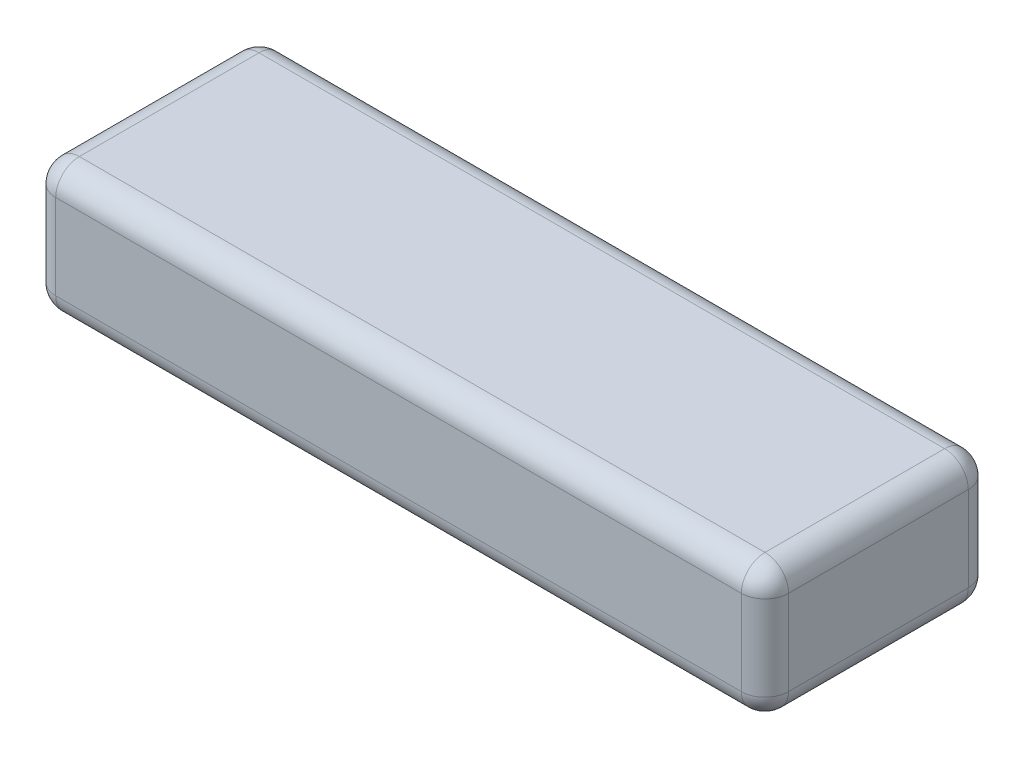
ISO-10303-21;
HEADER;
FILE_DESCRIPTION(('STEP AP214'),'2;1');
FILE_NAME('part.step','',(''),(''),'','','');
FILE_SCHEMA(('AUTOMOTIVE_DESIGN { 1 0 10303 214 1 1 1 1 }'));
ENDSEC;
DATA;
#1=APPLICATION_CONTEXT('core data for automotive mechanical design processes');
#2=APPLICATION_PROTOCOL_DEFINITION('international standard','automotive_design',2000,#1);
#3=PRODUCT_CONTEXT('',#1,'mechanical');
#4=PRODUCT('Part','Part','',(#3));
#5=PRODUCT_RELATED_PRODUCT_CATEGORY('part','',(#4));
#6=PRODUCT_DEFINITION_FORMATION('','',#4);
#7=PRODUCT_DEFINITION_CONTEXT('part definition',#1,'design');
#8=PRODUCT_DEFINITION('design','',#6,#7);
#9=PRODUCT_DEFINITION_SHAPE('','',#8);
#10=(LENGTH_UNIT() NAMED_UNIT(*) SI_UNIT(.MILLI.,.METRE.));
#11=(NAMED_UNIT(*) PLANE_ANGLE_UNIT() SI_UNIT($,.RADIAN.));
#12=(NAMED_UNIT(*) SI_UNIT($,.STERADIAN.) SOLID_ANGLE_UNIT());
#13=UNCERTAINTY_MEASURE_WITH_UNIT(LENGTH_MEASURE(1.E-05),#10,'distance_accuracy_value','');
#14=(GEOMETRIC_REPRESENTATION_CONTEXT(3) GLOBAL_UNCERTAINTY_ASSIGNED_CONTEXT((#13)) GLOBAL_UNIT_ASSIGNED_CONTEXT((#10,
#11,#12)) REPRESENTATION_CONTEXT('',''));
#15=CARTESIAN_POINT('',(0.,0.,0.));
#16=DIRECTION('',(0.,0.,1.));
#17=DIRECTION('',(1.,0.,0.));
#18=AXIS2_PLACEMENT_3D('',#15,#16,#17);
#19=CARTESIAN_POINT('',(0.,28.,0.));
#20=DIRECTION('',(1.,0.,0.));
#21=DIRECTION('',(0.,0.,-1.));
#22=AXIS2_PLACEMENT_3D('',#19,#20,#21);
#23=PLANE('',#22);
#24=DIRECTION('',(0.,-1.,0.));
#25=VECTOR('',#24,1.);
#26=CARTESIAN_POINT('',(0.,28.,-43.));
#27=LINE('',#26,#25);
#28=CARTESIAN_POINT('',(0.,23.,-43.));
#29=VERTEX_POINT('',#28);
#30=CARTESIAN_POINT('',(0.,5.,-43.));
#31=VERTEX_POINT('',#30);
#32=EDGE_CURVE('E241',#29,#31,#27,.T.);
#33=ORIENTED_EDGE('',*,*,#32,.T.);
#34=DIRECTION('',(0.,0.,1.));
#35=VECTOR('',#34,1.);
#36=CARTESIAN_POINT('',(0.,5.,0.));
#37=LINE('',#36,#35);
#38=CARTESIAN_POINT('',(0.,5.,-5.));
#39=VERTEX_POINT('',#38);
#40=EDGE_CURVE('E246',#31,#39,#37,.T.);
#41=ORIENTED_EDGE('',*,*,#40,.T.);
#42=DIRECTION('',(0.,-1.,0.));
#43=VECTOR('',#42,1.);
#44=CARTESIAN_POINT('',(0.,28.,-5.));
#45=LINE('',#44,#43);
#46=CARTESIAN_POINT('',(0.,23.,-5.));
#47=VERTEX_POINT('',#46);
#48=EDGE_CURVE('E247',#39,#47,#45,.F.);
#49=ORIENTED_EDGE('',*,*,#48,.T.);
#50=DIRECTION('',(0.,0.,1.));
#51=VECTOR('',#50,1.);
#52=CARTESIAN_POINT('',(0.,23.,0.));
#53=LINE('',#52,#51);
#54=EDGE_CURVE('E253',#47,#29,#53,.F.);
#55=ORIENTED_EDGE('',*,*,#54,.T.);
#56=EDGE_LOOP('',(#33,#41,#49,#55));
#57=FACE_BOUND('',#56,.T.);
#58=ADVANCED_FACE('F39',(#57),#23,.F.);
#59=CARTESIAN_POINT('',(0.,28.,0.));
#60=DIRECTION('',(0.,0.,-1.));
#61=DIRECTION('',(-1.,0.,0.));
#62=AXIS2_PLACEMENT_3D('',#59,#60,#61);
#63=PLANE('',#62);
#64=DIRECTION('',(0.,-1.,0.));
#65=VECTOR('',#64,1.);
#66=CARTESIAN_POINT('',(5.,28.,0.));
#67=LINE('',#66,#65);
#68=CARTESIAN_POINT('',(5.,23.,0.));
#69=VERTEX_POINT('',#68);
#70=CARTESIAN_POINT('',(5.,5.,0.));
#71=VERTEX_POINT('',#70);
#72=EDGE_CURVE('E143',#69,#71,#67,.T.);
#73=ORIENTED_EDGE('',*,*,#72,.T.);
#74=DIRECTION('',(1.,0.,0.));
#75=VECTOR('',#74,1.);
#76=CARTESIAN_POINT('',(155.,5.,0.));
#77=LINE('',#76,#75);
#78=CARTESIAN_POINT('',(150.,5.,0.));
#79=VERTEX_POINT('',#78);
#80=EDGE_CURVE('E138',#71,#79,#77,.T.);
#81=ORIENTED_EDGE('',*,*,#80,.T.);
#82=DIRECTION('',(0.,-1.,0.));
#83=VECTOR('',#82,1.);
#84=CARTESIAN_POINT('',(150.,28.,0.));
#85=LINE('',#84,#83);
#86=CARTESIAN_POINT('',(150.,23.,0.));
#87=VERTEX_POINT('',#86);
#88=EDGE_CURVE('E132',#79,#87,#85,.F.);
#89=ORIENTED_EDGE('',*,*,#88,.T.);
#90=DIRECTION('',(1.,0.,0.));
#91=VECTOR('',#90,1.);
#92=CARTESIAN_POINT('',(0.,23.,0.));
#93=LINE('',#92,#91);
#94=EDGE_CURVE('E135',#87,#69,#93,.F.);
#95=ORIENTED_EDGE('',*,*,#94,.T.);
#96=EDGE_LOOP('',(#73,#81,#89,#95));
#97=FACE_BOUND('',#96,.T.);
#98=ADVANCED_FACE('F134',(#97),#63,.F.);
#99=CARTESIAN_POINT('',(155.,28.,0.));
#100=DIRECTION('',(-1.,0.,0.));
#101=DIRECTION('',(0.,0.,1.));
#102=AXIS2_PLACEMENT_3D('',#99,#100,#101);
#103=PLANE('',#102);
#104=DIRECTION('',(0.,-1.,0.));
#105=VECTOR('',#104,1.);
#106=CARTESIAN_POINT('',(155.,28.,-5.));
#107=LINE('',#106,#105);
#108=CARTESIAN_POINT('',(155.,23.,-5.));
#109=VERTEX_POINT('',#108);
#110=CARTESIAN_POINT('',(155.,5.,-5.));
#111=VERTEX_POINT('',#110);
#112=EDGE_CURVE('E167',#109,#111,#107,.T.);
#113=ORIENTED_EDGE('',*,*,#112,.T.);
#114=DIRECTION('',(0.,0.,-1.));
#115=VECTOR('',#114,1.);
#116=CARTESIAN_POINT('',(155.,5.,-48.));
#117=LINE('',#116,#115);
#118=CARTESIAN_POINT('',(155.,5.,-43.));
#119=VERTEX_POINT('',#118);
#120=EDGE_CURVE('E321',#111,#119,#117,.T.);
#121=ORIENTED_EDGE('',*,*,#120,.T.);
#122=DIRECTION('',(0.,-1.,0.));
#123=VECTOR('',#122,1.);
#124=CARTESIAN_POINT('',(155.,28.,-43.));
#125=LINE('',#124,#123);
#126=CARTESIAN_POINT('',(155.,23.,-43.));
#127=VERTEX_POINT('',#126);
#128=EDGE_CURVE('E318',#119,#127,#125,.F.);
#129=ORIENTED_EDGE('',*,*,#128,.T.);
#130=DIRECTION('',(0.,0.,-1.));
#131=VECTOR('',#130,1.);
#132=CARTESIAN_POINT('',(155.,23.,0.));
#133=LINE('',#132,#131);
#134=EDGE_CURVE('E308',#127,#109,#133,.F.);
#135=ORIENTED_EDGE('',*,*,#134,.T.);
#136=EDGE_LOOP('',(#113,#121,#129,#135));
#137=FACE_BOUND('',#136,.T.);
#138=ADVANCED_FACE('F343',(#137),#103,.F.);
#139=CARTESIAN_POINT('',(0.,28.,-48.));
#140=DIRECTION('',(0.,0.,1.));
#141=DIRECTION('',(1.,0.,0.));
#142=AXIS2_PLACEMENT_3D('',#139,#140,#141);
#143=PLANE('',#142);
#144=DIRECTION('',(0.,-1.,0.));
#145=VECTOR('',#144,1.);
#146=CARTESIAN_POINT('',(150.,28.,-48.));
#147=LINE('',#146,#145);
#148=CARTESIAN_POINT('',(150.,23.,-48.));
#149=VERTEX_POINT('',#148);
#150=CARTESIAN_POINT('',(150.,5.,-48.));
#151=VERTEX_POINT('',#150);
#152=EDGE_CURVE('E328',#149,#151,#147,.T.);
#153=ORIENTED_EDGE('',*,*,#152,.T.);
#154=DIRECTION('',(-1.,0.,0.));
#155=VECTOR('',#154,1.);
#156=CARTESIAN_POINT('',(0.,5.,-48.));
#157=LINE('',#156,#155);
#158=CARTESIAN_POINT('',(5.,5.,-48.));
#159=VERTEX_POINT('',#158);
#160=EDGE_CURVE('E333',#151,#159,#157,.T.);
#161=ORIENTED_EDGE('',*,*,#160,.T.);
#162=DIRECTION('',(0.,-1.,0.));
#163=VECTOR('',#162,1.);
#164=CARTESIAN_POINT('',(5.,28.,-48.));
#165=LINE('',#164,#163);
#166=CARTESIAN_POINT('',(5.,23.,-48.));
#167=VERTEX_POINT('',#166);
#168=EDGE_CURVE('E239',#159,#167,#165,.F.);
#169=ORIENTED_EDGE('',*,*,#168,.T.);
#170=DIRECTION('',(-1.,0.,0.));
#171=VECTOR('',#170,1.);
#172=CARTESIAN_POINT('',(0.,23.,-48.));
#173=LINE('',#172,#171);
#174=EDGE_CURVE('E325',#167,#149,#173,.F.);
#175=ORIENTED_EDGE('',*,*,#174,.T.);
#176=EDGE_LOOP('',(#153,#161,#169,#175));
#177=FACE_BOUND('',#176,.T.);
#178=ADVANCED_FACE('F542',(#177),#143,.F.);
#179=CARTESIAN_POINT('',(0.,28.,0.));
#180=DIRECTION('',(0.,-1.,0.));
#181=DIRECTION('',(0.,0.,-1.));
#182=AXIS2_PLACEMENT_3D('',#179,#180,#181);
#183=PLANE('',#182);
#184=DIRECTION('',(1.,0.,0.));
#185=VECTOR('',#184,1.);
#186=CARTESIAN_POINT('',(0.,28.,-5.));
#187=LINE('',#186,#185);
#188=CARTESIAN_POINT('',(5.,28.,-5.));
#189=VERTEX_POINT('',#188);
#190=CARTESIAN_POINT('',(150.,28.,-5.));
#191=VERTEX_POINT('',#190);
#192=EDGE_CURVE('E251',#189,#191,#187,.T.);
#193=ORIENTED_EDGE('',*,*,#192,.T.);
#194=DIRECTION('',(0.,0.,-1.));
#195=VECTOR('',#194,1.);
#196=CARTESIAN_POINT('',(150.,28.,0.));
#197=LINE('',#196,#195);
#198=CARTESIAN_POINT('',(150.,28.,-43.));
#199=VERTEX_POINT('',#198);
#200=EDGE_CURVE('E11',#191,#199,#197,.T.);
#201=ORIENTED_EDGE('',*,*,#200,.T.);
#202=DIRECTION('',(-1.,0.,0.));
#203=VECTOR('',#202,1.);
#204=CARTESIAN_POINT('',(0.,28.,-43.));
#205=LINE('',#204,#203);
#206=CARTESIAN_POINT('',(5.,28.,-43.));
#207=VERTEX_POINT('',#206);
#208=EDGE_CURVE('E49',#199,#207,#205,.T.);
#209=ORIENTED_EDGE('',*,*,#208,.T.);
#210=DIRECTION('',(0.,0.,1.));
#211=VECTOR('',#210,1.);
#212=CARTESIAN_POINT('',(5.,28.,0.));
#213=LINE('',#212,#211);
#214=EDGE_CURVE('E259',#207,#189,#213,.T.);
#215=ORIENTED_EDGE('',*,*,#214,.T.);
#216=EDGE_LOOP('',(#193,#201,#209,#215));
#217=FACE_BOUND('',#216,.T.);
#218=ADVANCED_FACE('F340',(#217),#183,.F.);
#219=CARTESIAN_POINT('',(0.,0.,0.));
#220=DIRECTION('',(0.,-1.,0.));
#221=DIRECTION('',(0.,0.,-1.));
#222=AXIS2_PLACEMENT_3D('',#219,#220,#221);
#223=PLANE('',#222);
#224=DIRECTION('',(0.,0.,-1.));
#225=VECTOR('',#224,1.);
#226=CARTESIAN_POINT('',(150.,0.,0.));
#227=LINE('',#226,#225);
#228=CARTESIAN_POINT('',(150.,0.,-43.));
#229=VERTEX_POINT('',#228);
#230=CARTESIAN_POINT('',(150.,0.,-5.));
#231=VERTEX_POINT('',#230);
#232=EDGE_CURVE('E303',#229,#231,#227,.F.);
#233=ORIENTED_EDGE('',*,*,#232,.T.);
#234=DIRECTION('',(1.,0.,0.));
#235=VECTOR('',#234,1.);
#236=CARTESIAN_POINT('',(0.,0.,-5.));
#237=LINE('',#236,#235);
#238=CARTESIAN_POINT('',(5.,0.,-5.));
#239=VERTEX_POINT('',#238);
#240=EDGE_CURVE('E300',#231,#239,#237,.F.);
#241=ORIENTED_EDGE('',*,*,#240,.T.);
#242=DIRECTION('',(0.,0.,1.));
#243=VECTOR('',#242,1.);
#244=CARTESIAN_POINT('',(5.,0.,-48.));
#245=LINE('',#244,#243);
#246=CARTESIAN_POINT('',(5.,0.,-43.));
#247=VERTEX_POINT('',#246);
#248=EDGE_CURVE('E291',#239,#247,#245,.F.);
#249=ORIENTED_EDGE('',*,*,#248,.T.);
#250=DIRECTION('',(-1.,0.,0.));
#251=VECTOR('',#250,1.);
#252=CARTESIAN_POINT('',(155.,0.,-43.));
#253=LINE('',#252,#251);
#254=EDGE_CURVE('E297',#247,#229,#253,.F.);
#255=ORIENTED_EDGE('',*,*,#254,.T.);
#256=EDGE_LOOP('',(#233,#241,#249,#255));
#257=FACE_BOUND('',#256,.T.);
#258=ADVANCED_FACE('F301',(#257),#223,.T.);
#259=CARTESIAN_POINT('',(0.,23.,-43.));
#260=DIRECTION('',(-1.,0.,0.));
#261=DIRECTION('',(0.,0.,1.));
#262=AXIS2_PLACEMENT_3D('',#259,#260,#261);
#263=CYLINDRICAL_SURFACE('',#262,5.);
#264=CARTESIAN_POINT('',(5.,23.,-43.));
#265=DIRECTION('',(-1.,0.,0.));
#266=DIRECTION('',(0.,0.,1.));
#267=AXIS2_PLACEMENT_3D('',#264,#265,#266);
#268=CIRCLE('',#267,5.);
#269=EDGE_CURVE('E43',#207,#167,#268,.T.);
#270=ORIENTED_EDGE('',*,*,#269,.F.);
#271=ORIENTED_EDGE('',*,*,#208,.F.);
#272=CARTESIAN_POINT('',(150.,23.,-43.));
#273=DIRECTION('',(1.,0.,0.));
#274=DIRECTION('',(0.,0.,-1.));
#275=AXIS2_PLACEMENT_3D('',#272,#273,#274);
#276=CIRCLE('',#275,5.);
#277=EDGE_CURVE('E220',#149,#199,#276,.T.);
#278=ORIENTED_EDGE('',*,*,#277,.F.);
#279=ORIENTED_EDGE('',*,*,#174,.F.);
#280=EDGE_LOOP('',(#270,#271,#278,#279));
#281=FACE_BOUND('',#280,.T.);
#282=ADVANCED_FACE('F41',(#281),#263,.T.);
#283=CARTESIAN_POINT('',(5.,23.,-43.));
#284=DIRECTION('',(0.,0.,1.));
#285=DIRECTION('',(1.,0.,0.));
#286=AXIS2_PLACEMENT_3D('',#283,#284,#285);
#287=SPHERICAL_SURFACE('',#286,5.);
#288=CARTESIAN_POINT('',(5.,23.,-43.));
#289=DIRECTION('',(0.,0.,-1.));
#290=DIRECTION('',(-1.,0.,0.));
#291=AXIS2_PLACEMENT_3D('',#288,#289,#290);
#292=CIRCLE('',#291,5.);
#293=EDGE_CURVE('E213',#207,#29,#292,.F.);
#294=ORIENTED_EDGE('',*,*,#293,.F.);
#295=ORIENTED_EDGE('',*,*,#269,.T.);
#296=CARTESIAN_POINT('',(5.,23.,-43.));
#297=DIRECTION('',(0.,1.,0.));
#298=DIRECTION('',(0.,0.,1.));
#299=AXIS2_PLACEMENT_3D('',#296,#297,#298);
#300=CIRCLE('',#299,5.);
#301=EDGE_CURVE('E217',#29,#167,#300,.F.);
#302=ORIENTED_EDGE('',*,*,#301,.F.);
#303=EDGE_LOOP('',(#294,#295,#302));
#304=FACE_BOUND('',#303,.T.);
#305=ADVANCED_FACE('F230',(#304),#287,.T.);
#306=CARTESIAN_POINT('',(150.,23.,-43.));
#307=DIRECTION('',(0.,0.,1.));
#308=DIRECTION('',(1.,0.,0.));
#309=AXIS2_PLACEMENT_3D('',#306,#307,#308);
#310=SPHERICAL_SURFACE('',#309,5.);
#311=CARTESIAN_POINT('',(150.,23.,-43.));
#312=DIRECTION('',(0.,1.,0.));
#313=DIRECTION('',(0.,0.,1.));
#314=AXIS2_PLACEMENT_3D('',#311,#312,#313);
#315=CIRCLE('',#314,5.);
#316=EDGE_CURVE('E207',#149,#127,#315,.F.);
#317=ORIENTED_EDGE('',*,*,#316,.F.);
#318=ORIENTED_EDGE('',*,*,#277,.T.);
#319=CARTESIAN_POINT('',(150.,23.,-43.));
#320=DIRECTION('',(0.,0.,-1.));
#321=DIRECTION('',(-1.,0.,0.));
#322=AXIS2_PLACEMENT_3D('',#319,#320,#321);
#323=CIRCLE('',#322,5.);
#324=EDGE_CURVE('E57',#127,#199,#323,.F.);
#325=ORIENTED_EDGE('',*,*,#324,.F.);
#326=EDGE_LOOP('',(#317,#318,#325));
#327=FACE_BOUND('',#326,.T.);
#328=ADVANCED_FACE('F350',(#327),#310,.T.);
#329=CARTESIAN_POINT('',(5.,28.,-43.));
#330=DIRECTION('',(0.,-1.,0.));
#331=DIRECTION('',(0.,0.,-1.));
#332=AXIS2_PLACEMENT_3D('',#329,#330,#331);
#333=CYLINDRICAL_SURFACE('',#332,5.);
#334=ORIENTED_EDGE('',*,*,#301,.T.);
#335=ORIENTED_EDGE('',*,*,#168,.F.);
#336=CARTESIAN_POINT('',(5.,5.,-43.));
#337=DIRECTION('',(0.,-1.,0.));
#338=DIRECTION('',(0.,0.,-1.));
#339=AXIS2_PLACEMENT_3D('',#336,#337,#338);
#340=CIRCLE('',#339,5.);
#341=EDGE_CURVE('E200',#31,#159,#340,.T.);
#342=ORIENTED_EDGE('',*,*,#341,.F.);
#343=ORIENTED_EDGE('',*,*,#32,.F.);
#344=EDGE_LOOP('',(#334,#335,#342,#343));
#345=FACE_BOUND('',#344,.T.);
#346=ADVANCED_FACE('F237',(#345),#333,.T.);
#347=CARTESIAN_POINT('',(5.,23.,0.));
#348=DIRECTION('',(0.,0.,1.));
#349=DIRECTION('',(1.,0.,0.));
#350=AXIS2_PLACEMENT_3D('',#347,#348,#349);
#351=CYLINDRICAL_SURFACE('',#350,5.);
#352=ORIENTED_EDGE('',*,*,#293,.T.);
#353=ORIENTED_EDGE('',*,*,#54,.F.);
#354=CARTESIAN_POINT('',(5.,23.,-5.));
#355=DIRECTION('',(0.,0.,1.));
#356=DIRECTION('',(1.,0.,0.));
#357=AXIS2_PLACEMENT_3D('',#354,#355,#356);
#358=CIRCLE('',#357,5.);
#359=EDGE_CURVE('E196',#189,#47,#358,.T.);
#360=ORIENTED_EDGE('',*,*,#359,.F.);
#361=ORIENTED_EDGE('',*,*,#214,.F.);
#362=EDGE_LOOP('',(#352,#353,#360,#361));
#363=FACE_BOUND('',#362,.T.);
#364=ADVANCED_FACE('F339',(#363),#351,.T.);
#365=CARTESIAN_POINT('',(0.,23.,-5.));
#366=DIRECTION('',(1.,0.,0.));
#367=DIRECTION('',(0.,0.,-1.));
#368=AXIS2_PLACEMENT_3D('',#365,#366,#367);
#369=CYLINDRICAL_SURFACE('',#368,5.);
#370=CARTESIAN_POINT('',(150.,23.,-5.));
#371=DIRECTION('',(1.,0.,0.));
#372=DIRECTION('',(0.,0.,-1.));
#373=AXIS2_PLACEMENT_3D('',#370,#371,#372);
#374=CIRCLE('',#373,5.);
#375=EDGE_CURVE('E150',#191,#87,#374,.T.);
#376=ORIENTED_EDGE('',*,*,#375,.F.);
#377=ORIENTED_EDGE('',*,*,#192,.F.);
#378=CARTESIAN_POINT('',(5.,23.,-5.));
#379=DIRECTION('',(-1.,0.,0.));
#380=DIRECTION('',(0.,0.,1.));
#381=AXIS2_PLACEMENT_3D('',#378,#379,#380);
#382=CIRCLE('',#381,5.);
#383=EDGE_CURVE('E153',#69,#189,#382,.T.);
#384=ORIENTED_EDGE('',*,*,#383,.F.);
#385=ORIENTED_EDGE('',*,*,#94,.F.);
#386=EDGE_LOOP('',(#376,#377,#384,#385));
#387=FACE_BOUND('',#386,.T.);
#388=ADVANCED_FACE('F148',(#387),#369,.T.);
#389=CARTESIAN_POINT('',(150.,23.,0.));
#390=DIRECTION('',(0.,0.,-1.));
#391=DIRECTION('',(-1.,0.,0.));
#392=AXIS2_PLACEMENT_3D('',#389,#390,#391);
#393=CYLINDRICAL_SURFACE('',#392,5.);
#394=ORIENTED_EDGE('',*,*,#324,.T.);
#395=ORIENTED_EDGE('',*,*,#200,.F.);
#396=CARTESIAN_POINT('',(150.,23.,-5.));
#397=DIRECTION('',(0.,0.,1.));
#398=DIRECTION('',(1.,0.,0.));
#399=AXIS2_PLACEMENT_3D('',#396,#397,#398);
#400=CIRCLE('',#399,5.);
#401=EDGE_CURVE('E163',#109,#191,#400,.T.);
#402=ORIENTED_EDGE('',*,*,#401,.F.);
#403=ORIENTED_EDGE('',*,*,#134,.F.);
#404=EDGE_LOOP('',(#394,#395,#402,#403));
#405=FACE_BOUND('',#404,.T.);
#406=ADVANCED_FACE('F341',(#405),#393,.T.);
#407=CARTESIAN_POINT('',(150.,28.,-43.));
#408=DIRECTION('',(0.,-1.,0.));
#409=DIRECTION('',(0.,0.,-1.));
#410=AXIS2_PLACEMENT_3D('',#407,#408,#409);
#411=CYLINDRICAL_SURFACE('',#410,5.);
#412=ORIENTED_EDGE('',*,*,#316,.T.);
#413=ORIENTED_EDGE('',*,*,#128,.F.);
#414=CARTESIAN_POINT('',(150.,5.,-43.));
#415=DIRECTION('',(0.,-1.,0.));
#416=DIRECTION('',(0.,0.,-1.));
#417=AXIS2_PLACEMENT_3D('',#414,#415,#416);
#418=CIRCLE('',#417,5.);
#419=EDGE_CURVE('E188',#151,#119,#418,.T.);
#420=ORIENTED_EDGE('',*,*,#419,.F.);
#421=ORIENTED_EDGE('',*,*,#152,.F.);
#422=EDGE_LOOP('',(#412,#413,#420,#421));
#423=FACE_BOUND('',#422,.T.);
#424=ADVANCED_FACE('F349',(#423),#411,.T.);
#425=CARTESIAN_POINT('',(0.,5.,-43.));
#426=DIRECTION('',(1.,0.,0.));
#427=DIRECTION('',(0.,0.,-1.));
#428=AXIS2_PLACEMENT_3D('',#425,#426,#427);
#429=CYLINDRICAL_SURFACE('',#428,5.);
#430=CARTESIAN_POINT('',(5.,5.,-43.));
#431=DIRECTION('',(-1.,0.,0.));
#432=DIRECTION('',(0.,0.,1.));
#433=AXIS2_PLACEMENT_3D('',#430,#431,#432);
#434=CIRCLE('',#433,5.);
#435=EDGE_CURVE('E203',#159,#247,#434,.T.);
#436=ORIENTED_EDGE('',*,*,#435,.F.);
#437=ORIENTED_EDGE('',*,*,#160,.F.);
#438=CARTESIAN_POINT('',(150.,5.,-43.));
#439=DIRECTION('',(1.,0.,0.));
#440=DIRECTION('',(0.,0.,-1.));
#441=AXIS2_PLACEMENT_3D('',#438,#439,#440);
#442=CIRCLE('',#441,5.);
#443=EDGE_CURVE('E184',#229,#151,#442,.T.);
#444=ORIENTED_EDGE('',*,*,#443,.F.);
#445=ORIENTED_EDGE('',*,*,#254,.F.);
#446=EDGE_LOOP('',(#436,#437,#444,#445));
#447=FACE_BOUND('',#446,.T.);
#448=ADVANCED_FACE('F400',(#447),#429,.T.);
#449=CARTESIAN_POINT('',(5.,5.,-43.));
#450=DIRECTION('',(0.,0.,1.));
#451=DIRECTION('',(1.,0.,0.));
#452=AXIS2_PLACEMENT_3D('',#449,#450,#451);
#453=SPHERICAL_SURFACE('',#452,5.);
#454=ORIENTED_EDGE('',*,*,#341,.T.);
#455=ORIENTED_EDGE('',*,*,#435,.T.);
#456=CARTESIAN_POINT('',(5.,5.,-43.));
#457=DIRECTION('',(0.,0.,-1.));
#458=DIRECTION('',(-1.,0.,0.));
#459=AXIS2_PLACEMENT_3D('',#456,#457,#458);
#460=CIRCLE('',#459,5.);
#461=EDGE_CURVE('E175',#31,#247,#460,.F.);
#462=ORIENTED_EDGE('',*,*,#461,.F.);
#463=EDGE_LOOP('',(#454,#455,#462));
#464=FACE_BOUND('',#463,.T.);
#465=ADVANCED_FACE('F396',(#464),#453,.T.);
#466=CARTESIAN_POINT('',(5.,23.,-5.));
#467=DIRECTION('',(0.,0.,1.));
#468=DIRECTION('',(1.,0.,0.));
#469=AXIS2_PLACEMENT_3D('',#466,#467,#468);
#470=SPHERICAL_SURFACE('',#469,5.);
#471=ORIENTED_EDGE('',*,*,#383,.T.);
#472=ORIENTED_EDGE('',*,*,#359,.T.);
#473=CARTESIAN_POINT('',(5.,23.,-5.));
#474=DIRECTION('',(0.,1.,0.));
#475=DIRECTION('',(0.,0.,1.));
#476=AXIS2_PLACEMENT_3D('',#473,#474,#475);
#477=CIRCLE('',#476,5.);
#478=EDGE_CURVE('E169',#69,#47,#477,.F.);
#479=ORIENTED_EDGE('',*,*,#478,.F.);
#480=EDGE_LOOP('',(#471,#472,#479));
#481=FACE_BOUND('',#480,.T.);
#482=ADVANCED_FACE('F393',(#481),#470,.T.);
#483=CARTESIAN_POINT('',(150.,23.,-5.));
#484=DIRECTION('',(0.,0.,1.));
#485=DIRECTION('',(1.,0.,0.));
#486=AXIS2_PLACEMENT_3D('',#483,#484,#485);
#487=SPHERICAL_SURFACE('',#486,5.);
#488=ORIENTED_EDGE('',*,*,#401,.T.);
#489=ORIENTED_EDGE('',*,*,#375,.T.);
#490=CARTESIAN_POINT('',(150.,23.,-5.));
#491=DIRECTION('',(0.,1.,0.));
#492=DIRECTION('',(0.,0.,1.));
#493=AXIS2_PLACEMENT_3D('',#490,#491,#492);
#494=CIRCLE('',#493,5.);
#495=EDGE_CURVE('E160',#109,#87,#494,.F.);
#496=ORIENTED_EDGE('',*,*,#495,.F.);
#497=EDGE_LOOP('',(#488,#489,#496));
#498=FACE_BOUND('',#497,.T.);
#499=ADVANCED_FACE('F159',(#498),#487,.T.);
#500=CARTESIAN_POINT('',(150.,5.,-43.));
#501=DIRECTION('',(0.,0.,1.));
#502=DIRECTION('',(1.,0.,0.));
#503=AXIS2_PLACEMENT_3D('',#500,#501,#502);
#504=SPHERICAL_SURFACE('',#503,5.);
#505=ORIENTED_EDGE('',*,*,#443,.T.);
#506=ORIENTED_EDGE('',*,*,#419,.T.);
#507=CARTESIAN_POINT('',(150.,5.,-43.));
#508=DIRECTION('',(0.,0.,-1.));
#509=DIRECTION('',(-1.,0.,0.));
#510=AXIS2_PLACEMENT_3D('',#507,#508,#509);
#511=CIRCLE('',#510,5.);
#512=EDGE_CURVE('E170',#229,#119,#511,.F.);
#513=ORIENTED_EDGE('',*,*,#512,.F.);
#514=EDGE_LOOP('',(#505,#506,#513));
#515=FACE_BOUND('',#514,.T.);
#516=ADVANCED_FACE('F387',(#515),#504,.T.);
#517=CARTESIAN_POINT('',(5.,5.,0.));
#518=DIRECTION('',(0.,0.,-1.));
#519=DIRECTION('',(-1.,0.,0.));
#520=AXIS2_PLACEMENT_3D('',#517,#518,#519);
#521=CYLINDRICAL_SURFACE('',#520,5.);
#522=ORIENTED_EDGE('',*,*,#461,.T.);
#523=ORIENTED_EDGE('',*,*,#248,.F.);
#524=CARTESIAN_POINT('',(5.,5.,-5.));
#525=DIRECTION('',(0.,0.,1.));
#526=DIRECTION('',(1.,0.,0.));
#527=AXIS2_PLACEMENT_3D('',#524,#525,#526);
#528=CIRCLE('',#527,5.);
#529=EDGE_CURVE('E177',#39,#239,#528,.T.);
#530=ORIENTED_EDGE('',*,*,#529,.F.);
#531=ORIENTED_EDGE('',*,*,#40,.F.);
#532=EDGE_LOOP('',(#522,#523,#530,#531));
#533=FACE_BOUND('',#532,.T.);
#534=ADVANCED_FACE('F293',(#533),#521,.T.);
#535=CARTESIAN_POINT('',(5.,28.,-5.));
#536=DIRECTION('',(0.,-1.,0.));
#537=DIRECTION('',(0.,0.,-1.));
#538=AXIS2_PLACEMENT_3D('',#535,#536,#537);
#539=CYLINDRICAL_SURFACE('',#538,5.);
#540=ORIENTED_EDGE('',*,*,#478,.T.);
#541=ORIENTED_EDGE('',*,*,#48,.F.);
#542=CARTESIAN_POINT('',(5.,5.,-5.));
#543=DIRECTION('',(0.,-1.,0.));
#544=DIRECTION('',(0.,0.,-1.));
#545=AXIS2_PLACEMENT_3D('',#542,#543,#544);
#546=CIRCLE('',#545,5.);
#547=EDGE_CURVE('E278',#71,#39,#546,.T.);
#548=ORIENTED_EDGE('',*,*,#547,.F.);
#549=ORIENTED_EDGE('',*,*,#72,.F.);
#550=EDGE_LOOP('',(#540,#541,#548,#549));
#551=FACE_BOUND('',#550,.T.);
#552=ADVANCED_FACE('F381',(#551),#539,.T.);
#553=CARTESIAN_POINT('',(150.,28.,-5.));
#554=DIRECTION('',(0.,-1.,0.));
#555=DIRECTION('',(0.,0.,-1.));
#556=AXIS2_PLACEMENT_3D('',#553,#554,#555);
#557=CYLINDRICAL_SURFACE('',#556,5.);
#558=ORIENTED_EDGE('',*,*,#495,.T.);
#559=ORIENTED_EDGE('',*,*,#88,.F.);
#560=CARTESIAN_POINT('',(150.,5.,-5.));
#561=DIRECTION('',(0.,-1.,0.));
#562=DIRECTION('',(0.,0.,-1.));
#563=AXIS2_PLACEMENT_3D('',#560,#561,#562);
#564=CIRCLE('',#563,5.);
#565=EDGE_CURVE('E274',#111,#79,#564,.T.);
#566=ORIENTED_EDGE('',*,*,#565,.F.);
#567=ORIENTED_EDGE('',*,*,#112,.F.);
#568=EDGE_LOOP('',(#558,#559,#566,#567));
#569=FACE_BOUND('',#568,.T.);
#570=ADVANCED_FACE('F166',(#569),#557,.T.);
#571=CARTESIAN_POINT('',(150.,5.,0.));
#572=DIRECTION('',(0.,0.,1.));
#573=DIRECTION('',(1.,0.,0.));
#574=AXIS2_PLACEMENT_3D('',#571,#572,#573);
#575=CYLINDRICAL_SURFACE('',#574,5.);
#576=ORIENTED_EDGE('',*,*,#512,.T.);
#577=ORIENTED_EDGE('',*,*,#120,.F.);
#578=CARTESIAN_POINT('',(150.,5.,-5.));
#579=DIRECTION('',(0.,0.,1.));
#580=DIRECTION('',(1.,0.,0.));
#581=AXIS2_PLACEMENT_3D('',#578,#579,#580);
#582=CIRCLE('',#581,5.);
#583=EDGE_CURVE('E270',#231,#111,#582,.T.);
#584=ORIENTED_EDGE('',*,*,#583,.F.);
#585=ORIENTED_EDGE('',*,*,#232,.F.);
#586=EDGE_LOOP('',(#576,#577,#584,#585));
#587=FACE_BOUND('',#586,.T.);
#588=ADVANCED_FACE('F375',(#587),#575,.T.);
#589=CARTESIAN_POINT('',(5.,5.,-5.));
#590=DIRECTION('',(0.,0.,1.));
#591=DIRECTION('',(1.,0.,0.));
#592=AXIS2_PLACEMENT_3D('',#589,#590,#591);
#593=SPHERICAL_SURFACE('',#592,5.);
#594=ORIENTED_EDGE('',*,*,#547,.T.);
#595=ORIENTED_EDGE('',*,*,#529,.T.);
#596=CARTESIAN_POINT('',(5.,5.,-5.));
#597=DIRECTION('',(-1.,0.,0.));
#598=DIRECTION('',(0.,0.,1.));
#599=AXIS2_PLACEMENT_3D('',#596,#597,#598);
#600=CIRCLE('',#599,5.);
#601=EDGE_CURVE('E267',#71,#239,#600,.F.);
#602=ORIENTED_EDGE('',*,*,#601,.F.);
#603=EDGE_LOOP('',(#594,#595,#602));
#604=FACE_BOUND('',#603,.T.);
#605=ADVANCED_FACE('F286',(#604),#593,.T.);
#606=CARTESIAN_POINT('',(150.,5.,-5.));
#607=DIRECTION('',(0.,0.,1.));
#608=DIRECTION('',(1.,0.,0.));
#609=AXIS2_PLACEMENT_3D('',#606,#607,#608);
#610=SPHERICAL_SURFACE('',#609,5.);
#611=ORIENTED_EDGE('',*,*,#583,.T.);
#612=ORIENTED_EDGE('',*,*,#565,.T.);
#613=CARTESIAN_POINT('',(150.,5.,-5.));
#614=DIRECTION('',(1.,0.,0.));
#615=DIRECTION('',(0.,0.,-1.));
#616=AXIS2_PLACEMENT_3D('',#613,#614,#615);
#617=CIRCLE('',#616,5.);
#618=EDGE_CURVE('E264',#231,#79,#617,.F.);
#619=ORIENTED_EDGE('',*,*,#618,.F.);
#620=EDGE_LOOP('',(#611,#612,#619));
#621=FACE_BOUND('',#620,.T.);
#622=ADVANCED_FACE('F369',(#621),#610,.T.);
#623=CARTESIAN_POINT('',(0.,5.,-5.));
#624=DIRECTION('',(-1.,0.,0.));
#625=DIRECTION('',(0.,0.,1.));
#626=AXIS2_PLACEMENT_3D('',#623,#624,#625);
#627=CYLINDRICAL_SURFACE('',#626,5.);
#628=ORIENTED_EDGE('',*,*,#601,.T.);
#629=ORIENTED_EDGE('',*,*,#240,.F.);
#630=ORIENTED_EDGE('',*,*,#618,.T.);
#631=ORIENTED_EDGE('',*,*,#80,.F.);
#632=EDGE_LOOP('',(#628,#629,#630,#631));
#633=FACE_BOUND('',#632,.T.);
#634=ADVANCED_FACE('F366',(#633),#627,.T.);
#635=CLOSED_SHELL('',(#58,#98,#138,#178,#218,#258,#282,#305,#328,#346,#364,#388,#406,#424,#448,
#465,#482,#499,#516,#534,#552,#570,#588,#605,#622,#634));
#636=MANIFOLD_SOLID_BREP('B2',#635);
#637=ADVANCED_BREP_SHAPE_REPRESENTATION('',(#18,#636),#14);
#638=SHAPE_DEFINITION_REPRESENTATION(#9,#637);
ENDSEC;
END-ISO-10303-21;
